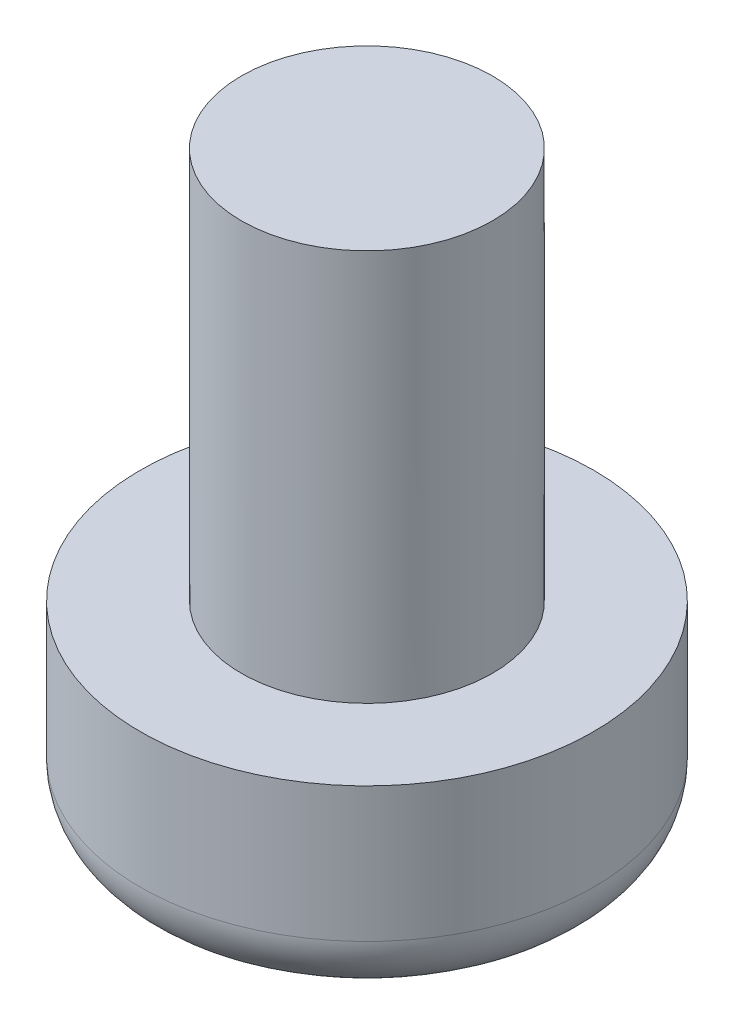
ISO-10303-21;
HEADER;
FILE_DESCRIPTION(('STEP AP214'),'2;1');
FILE_NAME('part.step','',(''),(''),'','','');
FILE_SCHEMA(('AUTOMOTIVE_DESIGN { 1 0 10303 214 1 1 1 1 }'));
ENDSEC;
DATA;
#1=APPLICATION_CONTEXT('core data for automotive mechanical design processes');
#2=APPLICATION_PROTOCOL_DEFINITION('international standard','automotive_design',2000,#1);
#3=PRODUCT_CONTEXT('',#1,'mechanical');
#4=PRODUCT('Part','Part','',(#3));
#5=PRODUCT_RELATED_PRODUCT_CATEGORY('part','',(#4));
#6=PRODUCT_DEFINITION_FORMATION('','',#4);
#7=PRODUCT_DEFINITION_CONTEXT('part definition',#1,'design');
#8=PRODUCT_DEFINITION('design','',#6,#7);
#9=PRODUCT_DEFINITION_SHAPE('','',#8);
#10=(LENGTH_UNIT() NAMED_UNIT(*) SI_UNIT(.MILLI.,.METRE.));
#11=(NAMED_UNIT(*) PLANE_ANGLE_UNIT() SI_UNIT($,.RADIAN.));
#12=(NAMED_UNIT(*) SI_UNIT($,.STERADIAN.) SOLID_ANGLE_UNIT());
#13=UNCERTAINTY_MEASURE_WITH_UNIT(LENGTH_MEASURE(1.E-05),#10,'distance_accuracy_value','');
#14=(GEOMETRIC_REPRESENTATION_CONTEXT(3) GLOBAL_UNCERTAINTY_ASSIGNED_CONTEXT((#13)) GLOBAL_UNIT_ASSIGNED_CONTEXT((#10,
#11,#12)) REPRESENTATION_CONTEXT('',''));
#15=CARTESIAN_POINT('',(0.,0.,0.));
#16=DIRECTION('',(0.,0.,1.));
#17=DIRECTION('',(1.,0.,0.));
#18=AXIS2_PLACEMENT_3D('',#15,#16,#17);
#19=CARTESIAN_POINT('',(69.6002990351062,-6.1,7.90828785840455));
#20=DIRECTION('',(0.,-1.,0.));
#21=DIRECTION('',(0.,0.,-1.));
#22=AXIS2_PLACEMENT_3D('',#19,#20,#21);
#23=CYLINDRICAL_SURFACE('',#22,1.85);
#24=CARTESIAN_POINT('',(69.6002990351062,-7.2,7.90828785840455));
#25=DIRECTION('',(0.,-1.,0.));
#26=DIRECTION('',(0.,0.,-1.));
#27=AXIS2_PLACEMENT_3D('',#24,#25,#26);
#28=CIRCLE('',#27,1.85);
#29=CARTESIAN_POINT('',(69.6002990351062,-7.2,6.05828785840454));
#30=VERTEX_POINT('',#29);
#31=EDGE_CURVE('E10',#30,#30,#28,.F.);
#32=ORIENTED_EDGE('',*,*,#31,.T.);
#33=EDGE_LOOP('',(#32));
#34=FACE_BOUND('',#33,.T.);
#35=CARTESIAN_POINT('',(69.6002990351062,-6.1,7.90828785840455));
#36=DIRECTION('',(0.,-1.,0.));
#37=DIRECTION('',(0.,0.,-1.));
#38=AXIS2_PLACEMENT_3D('',#35,#36,#37);
#39=CIRCLE('',#38,1.85);
#40=CARTESIAN_POINT('',(69.6002990351062,-6.1,6.05828785840454));
#41=VERTEX_POINT('',#40);
#42=EDGE_CURVE('E42',#41,#41,#39,.T.);
#43=ORIENTED_EDGE('',*,*,#42,.T.);
#44=EDGE_LOOP('',(#43));
#45=FACE_BOUND('',#44,.T.);
#46=ADVANCED_FACE('F31',(#34,#45),#23,.T.);
#47=CARTESIAN_POINT('',(69.6002990351062,-6.1,7.90828785840455));
#48=DIRECTION('',(0.,-1.,0.));
#49=DIRECTION('',(0.,0.,-1.));
#50=AXIS2_PLACEMENT_3D('',#47,#48,#49);
#51=PLANE('',#50);
#52=CARTESIAN_POINT('',(69.6002990351062,-6.1,7.90828785840455));
#53=DIRECTION('',(0.,-1.,0.));
#54=DIRECTION('',(0.,0.,-1.));
#55=AXIS2_PLACEMENT_3D('',#52,#53,#54);
#56=CIRCLE('',#55,1.025);
#57=CARTESIAN_POINT('',(69.6002990351062,-6.1,6.88328785840455));
#58=VERTEX_POINT('',#57);
#59=EDGE_CURVE('E46',#58,#58,#56,.T.);
#60=ORIENTED_EDGE('',*,*,#59,.T.);
#61=EDGE_LOOP('',(#60));
#62=FACE_BOUND('',#61,.T.);
#63=ORIENTED_EDGE('',*,*,#42,.F.);
#64=EDGE_LOOP('',(#63));
#65=FACE_BOUND('',#64,.T.);
#66=ADVANCED_FACE('F70',(#62,#65),#51,.F.);
#67=CARTESIAN_POINT('',(69.6002990351062,-7.7,7.90828785840455));
#68=DIRECTION('',(0.,-1.,0.));
#69=DIRECTION('',(0.,0.,-1.));
#70=AXIS2_PLACEMENT_3D('',#67,#68,#69);
#71=PLANE('',#70);
#72=CARTESIAN_POINT('',(69.6002990351062,-7.7,7.90828785840455));
#73=DIRECTION('',(0.,-1.,0.));
#74=DIRECTION('',(0.,0.,-1.));
#75=AXIS2_PLACEMENT_3D('',#72,#73,#74);
#76=CIRCLE('',#75,1.35);
#77=CARTESIAN_POINT('',(69.6002990351062,-7.7,6.55828785840454));
#78=VERTEX_POINT('',#77);
#79=EDGE_CURVE('E38',#78,#78,#76,.T.);
#80=ORIENTED_EDGE('',*,*,#79,.T.);
#81=EDGE_LOOP('',(#80));
#82=FACE_BOUND('',#81,.T.);
#83=ADVANCED_FACE('F66',(#82),#71,.T.);
#84=CARTESIAN_POINT('',(69.6002990351062,-0.000862197135164007,7.90828785840455));
#85=DIRECTION('',(0.,-1.,0.));
#86=DIRECTION('',(0.,0.,-1.));
#87=AXIS2_PLACEMENT_3D('',#84,#85,#86);
#88=CYLINDRICAL_SURFACE('',#87,1.025);
#89=CARTESIAN_POINT('',(69.6002990351062,-2.9,7.90828785840455));
#90=DIRECTION('',(0.,1.,0.));
#91=DIRECTION('',(0.,0.,1.));
#92=AXIS2_PLACEMENT_3D('',#89,#90,#91);
#93=CIRCLE('',#92,1.025);
#94=CARTESIAN_POINT('',(69.6002990351062,-2.9,8.93328785840455));
#95=VERTEX_POINT('',#94);
#96=EDGE_CURVE('E51',#95,#95,#93,.F.);
#97=ORIENTED_EDGE('',*,*,#96,.T.);
#98=EDGE_LOOP('',(#97));
#99=FACE_BOUND('',#98,.T.);
#100=ORIENTED_EDGE('',*,*,#59,.F.);
#101=EDGE_LOOP('',(#100));
#102=FACE_BOUND('',#101,.T.);
#103=ADVANCED_FACE('F55',(#99,#102),#88,.T.);
#104=CARTESIAN_POINT('',(94.5,-2.9,0.));
#105=DIRECTION('',(0.,1.,0.));
#106=DIRECTION('',(0.,0.,1.));
#107=AXIS2_PLACEMENT_3D('',#104,#105,#106);
#108=PLANE('',#107);
#109=ORIENTED_EDGE('',*,*,#96,.F.);
#110=EDGE_LOOP('',(#109));
#111=FACE_BOUND('',#110,.T.);
#112=ADVANCED_FACE('F58',(#111),#108,.T.);
#113=CARTESIAN_POINT('',(69.6002990351062,-7.2,7.90828785840455));
#114=DIRECTION('',(0.,-1.,0.));
#115=DIRECTION('',(0.,0.,-1.));
#116=AXIS2_PLACEMENT_3D('',#113,#114,#115);
#117=TOROIDAL_SURFACE('',#116,1.35,0.5);
#118=ORIENTED_EDGE('',*,*,#31,.F.);
#119=EDGE_LOOP('',(#118));
#120=FACE_BOUND('',#119,.T.);
#121=ORIENTED_EDGE('',*,*,#79,.F.);
#122=EDGE_LOOP('',(#121));
#123=FACE_BOUND('',#122,.T.);
#124=ADVANCED_FACE('F33',(#120,#123),#117,.T.);
#125=CLOSED_SHELL('',(#46,#66,#83,#103,#112,#124));
#126=MANIFOLD_SOLID_BREP('B2',#125);
#127=ADVANCED_BREP_SHAPE_REPRESENTATION('',(#18,#126),#14);
#128=SHAPE_DEFINITION_REPRESENTATION(#9,#127);
ENDSEC;
END-ISO-10303-21;
